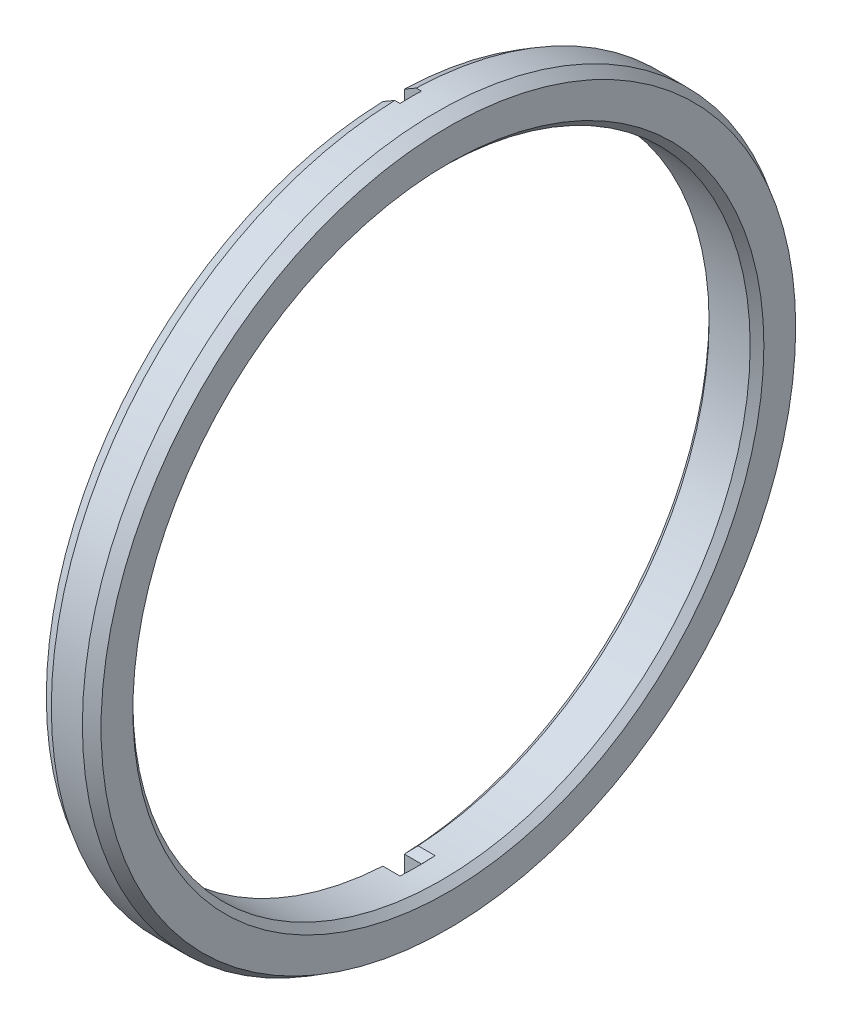
ISO-10303-21;
HEADER;
FILE_DESCRIPTION(('STEP AP214'),'2;1');
FILE_NAME('part.step','',(''),(''),'','','');
FILE_SCHEMA(('AUTOMOTIVE_DESIGN { 1 0 10303 214 1 1 1 1 }'));
ENDSEC;
DATA;
#1=APPLICATION_CONTEXT('core data for automotive mechanical design processes');
#2=APPLICATION_PROTOCOL_DEFINITION('international standard','automotive_design',2000,#1);
#3=PRODUCT_CONTEXT('',#1,'mechanical');
#4=PRODUCT('Part','Part','',(#3));
#5=PRODUCT_RELATED_PRODUCT_CATEGORY('part','',(#4));
#6=PRODUCT_DEFINITION_FORMATION('','',#4);
#7=PRODUCT_DEFINITION_CONTEXT('part definition',#1,'design');
#8=PRODUCT_DEFINITION('design','',#6,#7);
#9=PRODUCT_DEFINITION_SHAPE('','',#8);
#10=(LENGTH_UNIT() NAMED_UNIT(*) SI_UNIT(.MILLI.,.METRE.));
#11=(NAMED_UNIT(*) PLANE_ANGLE_UNIT() SI_UNIT($,.RADIAN.));
#12=(NAMED_UNIT(*) SI_UNIT($,.STERADIAN.) SOLID_ANGLE_UNIT());
#13=UNCERTAINTY_MEASURE_WITH_UNIT(LENGTH_MEASURE(1.E-05),#10,'distance_accuracy_value','');
#14=(GEOMETRIC_REPRESENTATION_CONTEXT(3) GLOBAL_UNCERTAINTY_ASSIGNED_CONTEXT((#13)) GLOBAL_UNIT_ASSIGNED_CONTEXT((#10,
#11,#12)) REPRESENTATION_CONTEXT('',''));
#15=CARTESIAN_POINT('',(0.,0.,0.));
#16=DIRECTION('',(0.,0.,1.));
#17=DIRECTION('',(1.,0.,0.));
#18=AXIS2_PLACEMENT_3D('',#15,#16,#17);
#19=CARTESIAN_POINT('',(2.032,0.,0.));
#20=DIRECTION('',(-1.,0.,0.));
#21=DIRECTION('',(0.,0.,1.));
#22=AXIS2_PLACEMENT_3D('',#19,#20,#21);
#23=CYLINDRICAL_SURFACE('',#22,13.1445);
#24=CARTESIAN_POINT('',(1.59257999999999,0.,0.));
#25=DIRECTION('',(1.,0.,0.));
#26=DIRECTION('',(0.,0.,-1.));
#27=AXIS2_PLACEMENT_3D('',#24,#25,#26);
#28=CIRCLE('',#27,13.1445);
#29=CARTESIAN_POINT('',(1.59257999999999,0.,-13.1445));
#30=VERTEX_POINT('',#29);
#31=EDGE_CURVE('E196',#30,#30,#28,.F.);
#32=ORIENTED_EDGE('',*,*,#31,.T.);
#33=EDGE_LOOP('',(#32));
#34=FACE_BOUND('',#33,.T.);
#35=DIRECTION('',(-1.,0.,0.));
#36=VECTOR('',#35,1.);
#37=CARTESIAN_POINT('',(0.635,13.1385071634632,0.396874999999998));
#38=LINE('',#37,#36);
#39=CARTESIAN_POINT('',(0.635,13.1385071634632,0.396874999999998));
#40=VERTEX_POINT('',#39);
#41=CARTESIAN_POINT('',(0.439420000000001,13.1385071634632,0.396874999999998));
#42=VERTEX_POINT('',#41);
#43=EDGE_CURVE('E173',#40,#42,#38,.T.);
#44=ORIENTED_EDGE('',*,*,#43,.T.);
#45=CARTESIAN_POINT('',(0.439419999999999,0.,0.));
#46=DIRECTION('',(1.,0.,0.));
#47=DIRECTION('',(0.,0.,-1.));
#48=AXIS2_PLACEMENT_3D('',#45,#46,#47);
#49=CIRCLE('',#48,13.1445);
#50=CARTESIAN_POINT('',(0.439420000000001,-13.1385071634632,0.396874999999998));
#51=VERTEX_POINT('',#50);
#52=EDGE_CURVE('E200',#42,#51,#49,.T.);
#53=ORIENTED_EDGE('',*,*,#52,.T.);
#54=DIRECTION('',(-1.,0.,0.));
#55=VECTOR('',#54,1.);
#56=CARTESIAN_POINT('',(0.635,-13.1385071634632,0.396874999999998));
#57=LINE('',#56,#55);
#58=CARTESIAN_POINT('',(0.635,-13.1385071634632,0.396874999999998));
#59=VERTEX_POINT('',#58);
#60=EDGE_CURVE('E190',#59,#51,#57,.T.);
#61=ORIENTED_EDGE('',*,*,#60,.F.);
#62=CARTESIAN_POINT('',(0.635,0.,0.));
#63=DIRECTION('',(1.,0.,0.));
#64=DIRECTION('',(0.,0.,-1.));
#65=AXIS2_PLACEMENT_3D('',#62,#63,#64);
#66=CIRCLE('',#65,13.1445);
#67=CARTESIAN_POINT('',(0.635,-13.1385071634632,-0.396874999999999));
#68=VERTEX_POINT('',#67);
#69=EDGE_CURVE('E182',#59,#68,#66,.T.);
#70=ORIENTED_EDGE('',*,*,#69,.T.);
#71=DIRECTION('',(-1.,0.,0.));
#72=VECTOR('',#71,1.);
#73=CARTESIAN_POINT('',(0.635,-13.1385071634632,-0.396874999999999));
#74=LINE('',#73,#72);
#75=CARTESIAN_POINT('',(0.439420000000001,-13.1385071634632,-0.396874999999999));
#76=VERTEX_POINT('',#75);
#77=EDGE_CURVE('E186',#68,#76,#74,.T.);
#78=ORIENTED_EDGE('',*,*,#77,.T.);
#79=CARTESIAN_POINT('',(0.439419999999999,0.,0.));
#80=DIRECTION('',(1.,0.,0.));
#81=DIRECTION('',(0.,0.,-1.));
#82=AXIS2_PLACEMENT_3D('',#79,#80,#81);
#83=CIRCLE('',#82,13.1445);
#84=CARTESIAN_POINT('',(0.439420000000001,13.1385071634632,-0.396874999999999));
#85=VERTEX_POINT('',#84);
#86=EDGE_CURVE('E171',#76,#85,#83,.T.);
#87=ORIENTED_EDGE('',*,*,#86,.T.);
#88=DIRECTION('',(-1.,0.,0.));
#89=VECTOR('',#88,1.);
#90=CARTESIAN_POINT('',(0.635,13.1385071634632,-0.396874999999999));
#91=LINE('',#90,#89);
#92=CARTESIAN_POINT('',(0.635,13.1385071634632,-0.396874999999999));
#93=VERTEX_POINT('',#92);
#94=EDGE_CURVE('E153',#93,#85,#91,.T.);
#95=ORIENTED_EDGE('',*,*,#94,.F.);
#96=CARTESIAN_POINT('',(0.635,0.,0.));
#97=DIRECTION('',(1.,0.,0.));
#98=DIRECTION('',(0.,0.,-1.));
#99=AXIS2_PLACEMENT_3D('',#96,#97,#98);
#100=CIRCLE('',#99,13.1445);
#101=EDGE_CURVE('E157',#93,#40,#100,.T.);
#102=ORIENTED_EDGE('',*,*,#101,.T.);
#103=EDGE_LOOP('',(#44,#53,#61,#70,#78,#87,#95,#102));
#104=FACE_BOUND('',#103,.T.);
#105=ADVANCED_FACE('F16',(#34,#104),#23,.T.);
#106=CARTESIAN_POINT('',(2.032,0.,0.));
#107=DIRECTION('',(-1.,0.,0.));
#108=DIRECTION('',(0.,0.,1.));
#109=AXIS2_PLACEMENT_3D('',#106,#107,#108);
#110=CYLINDRICAL_SURFACE('',#109,11.4554);
#111=CARTESIAN_POINT('',(0.253999999999999,0.,0.));
#112=DIRECTION('',(1.,0.,0.));
#113=DIRECTION('',(0.,0.,-1.));
#114=AXIS2_PLACEMENT_3D('',#111,#112,#113);
#115=CIRCLE('',#114,11.4554);
#116=CARTESIAN_POINT('',(0.253999999999999,-11.4367385704286,0.653605409762341));
#117=VERTEX_POINT('',#116);
#118=CARTESIAN_POINT('',(0.253999999999999,11.4367385704286,0.653605409762343));
#119=VERTEX_POINT('',#118);
#120=EDGE_CURVE('E412',#117,#119,#115,.F.);
#121=ORIENTED_EDGE('',*,*,#120,.T.);
#122=DIRECTION('',(-1.,0.,0.));
#123=VECTOR('',#122,1.);
#124=CARTESIAN_POINT('',(2.032,11.4367385704286,0.653605409762343));
#125=LINE('',#124,#123);
#126=CARTESIAN_POINT('',(0.888999999999999,11.4367385704286,0.653605409762343));
#127=VERTEX_POINT('',#126);
#128=EDGE_CURVE('E414',#119,#127,#125,.F.);
#129=ORIENTED_EDGE('',*,*,#128,.T.);
#130=CARTESIAN_POINT('',(0.888999999999999,0.,0.));
#131=DIRECTION('',(1.,0.,0.));
#132=DIRECTION('',(0.,0.,-1.));
#133=AXIS2_PLACEMENT_3D('',#130,#131,#132);
#134=CIRCLE('',#133,11.4554);
#135=CARTESIAN_POINT('',(0.888999999999999,11.4367385704286,-0.653605409762338));
#136=VERTEX_POINT('',#135);
#137=EDGE_CURVE('E398',#127,#136,#134,.F.);
#138=ORIENTED_EDGE('',*,*,#137,.T.);
#139=DIRECTION('',(-1.,0.,0.));
#140=VECTOR('',#139,1.);
#141=CARTESIAN_POINT('',(2.032,11.4367385704286,-0.653605409762338));
#142=LINE('',#141,#140);
#143=CARTESIAN_POINT('',(0.253999999999999,11.4367385704286,-0.653605409762338));
#144=VERTEX_POINT('',#143);
#145=EDGE_CURVE('E399',#136,#144,#142,.T.);
#146=ORIENTED_EDGE('',*,*,#145,.T.);
#147=CARTESIAN_POINT('',(0.253999999999999,0.,0.));
#148=DIRECTION('',(1.,0.,0.));
#149=DIRECTION('',(0.,0.,-1.));
#150=AXIS2_PLACEMENT_3D('',#147,#148,#149);
#151=CIRCLE('',#150,11.4554);
#152=CARTESIAN_POINT('',(0.253999999999999,-11.4367385704286,-0.653605409762342));
#153=VERTEX_POINT('',#152);
#154=EDGE_CURVE('E404',#144,#153,#151,.F.);
#155=ORIENTED_EDGE('',*,*,#154,.T.);
#156=DIRECTION('',(-1.,0.,0.));
#157=VECTOR('',#156,1.);
#158=CARTESIAN_POINT('',(2.032,-11.4367385704286,-0.653605409762342));
#159=LINE('',#158,#157);
#160=CARTESIAN_POINT('',(0.888999999999999,-11.4367385704286,-0.653605409762342));
#161=VERTEX_POINT('',#160);
#162=EDGE_CURVE('E406',#153,#161,#159,.F.);
#163=ORIENTED_EDGE('',*,*,#162,.T.);
#164=CARTESIAN_POINT('',(0.888999999999999,0.,0.));
#165=DIRECTION('',(1.,0.,0.));
#166=DIRECTION('',(0.,0.,-1.));
#167=AXIS2_PLACEMENT_3D('',#164,#165,#166);
#168=CIRCLE('',#167,11.4554);
#169=CARTESIAN_POINT('',(0.888999999999999,-11.4367385704286,0.653605409762341));
#170=VERTEX_POINT('',#169);
#171=EDGE_CURVE('E408',#161,#170,#168,.F.);
#172=ORIENTED_EDGE('',*,*,#171,.T.);
#173=DIRECTION('',(-1.,0.,0.));
#174=VECTOR('',#173,1.);
#175=CARTESIAN_POINT('',(2.032,-11.4367385704286,0.653605409762341));
#176=LINE('',#175,#174);
#177=EDGE_CURVE('E410',#170,#117,#176,.T.);
#178=ORIENTED_EDGE('',*,*,#177,.T.);
#179=EDGE_LOOP('',(#121,#129,#138,#146,#155,#163,#172,#178));
#180=FACE_BOUND('',#179,.T.);
#181=CARTESIAN_POINT('',(1.77800000000001,0.,0.));
#182=DIRECTION('',(1.,0.,0.));
#183=DIRECTION('',(0.,0.,-1.));
#184=AXIS2_PLACEMENT_3D('',#181,#182,#183);
#185=CIRCLE('',#184,11.4554);
#186=CARTESIAN_POINT('',(1.77800000000001,0.,-11.4554));
#187=VERTEX_POINT('',#186);
#188=EDGE_CURVE('E396',#187,#187,#185,.T.);
#189=ORIENTED_EDGE('',*,*,#188,.T.);
#190=EDGE_LOOP('',(#189));
#191=FACE_BOUND('',#190,.T.);
#192=ADVANCED_FACE('F454',(#180,#191),#110,.F.);
#193=CARTESIAN_POINT('',(0.,0.,-29.0593213562373));
#194=DIRECTION('',(1.,0.,0.));
#195=DIRECTION('',(0.,0.,-1.));
#196=AXIS2_PLACEMENT_3D('',#193,#194,#195);
#197=PLANE('',#196);
#198=DIRECTION('',(0.,-1.,0.));
#199=VECTOR('',#198,1.);
#200=CARTESIAN_POINT('',(0.,0.,-0.396874999999997));
#201=LINE('',#200,#199);
#202=CARTESIAN_POINT('',(0.,-11.7026722843278,-0.396874999999999));
#203=VERTEX_POINT('',#202);
#204=CARTESIAN_POINT('',(0.,-12.8843890225488,-0.396874999999999));
#205=VERTEX_POINT('',#204);
#206=EDGE_CURVE('E175',#203,#205,#201,.T.);
#207=ORIENTED_EDGE('',*,*,#206,.F.);
#208=CARTESIAN_POINT('',(0.,0.,0.));
#209=DIRECTION('',(1.,0.,0.));
#210=DIRECTION('',(0.,0.,-1.));
#211=AXIS2_PLACEMENT_3D('',#208,#209,#210);
#212=CIRCLE('',#211,11.7094);
#213=CARTESIAN_POINT('',(0.,11.7026722843278,-0.396874999999999));
#214=VERTEX_POINT('',#213);
#215=EDGE_CURVE('E377',#203,#214,#212,.T.);
#216=ORIENTED_EDGE('',*,*,#215,.T.);
#217=DIRECTION('',(0.,1.,0.));
#218=VECTOR('',#217,1.);
#219=CARTESIAN_POINT('',(0.,0.,-0.396874999999997));
#220=LINE('',#219,#218);
#221=CARTESIAN_POINT('',(0.,12.8843890225488,-0.396874999999999));
#222=VERTEX_POINT('',#221);
#223=EDGE_CURVE('E442',#214,#222,#220,.T.);
#224=ORIENTED_EDGE('',*,*,#223,.T.);
#225=CARTESIAN_POINT('',(0.,0.,0.));
#226=DIRECTION('',(1.,0.,0.));
#227=DIRECTION('',(0.,0.,-1.));
#228=AXIS2_PLACEMENT_3D('',#225,#226,#227);
#229=CIRCLE('',#228,12.8905);
#230=EDGE_CURVE('E461',#222,#205,#229,.F.);
#231=ORIENTED_EDGE('',*,*,#230,.T.);
#232=EDGE_LOOP('',(#207,#216,#224,#231));
#233=FACE_BOUND('',#232,.T.);
#234=ADVANCED_FACE('F459',(#233),#197,.F.);
#235=DIRECTION('',(0.,-1.,0.));
#236=VECTOR('',#235,1.);
#237=CARTESIAN_POINT('',(0.,0.,0.396875));
#238=LINE('',#237,#236);
#239=CARTESIAN_POINT('',(0.,12.8843890225488,0.396874999999998));
#240=VERTEX_POINT('',#239);
#241=CARTESIAN_POINT('',(0.,11.7026722843278,0.396874999999999));
#242=VERTEX_POINT('',#241);
#243=EDGE_CURVE('E158',#240,#242,#238,.T.);
#244=ORIENTED_EDGE('',*,*,#243,.T.);
#245=CARTESIAN_POINT('',(0.,0.,0.));
#246=DIRECTION('',(1.,0.,0.));
#247=DIRECTION('',(0.,0.,-1.));
#248=AXIS2_PLACEMENT_3D('',#245,#246,#247);
#249=CIRCLE('',#248,11.7094);
#250=CARTESIAN_POINT('',(0.,-11.7026722843278,0.396874999999999));
#251=VERTEX_POINT('',#250);
#252=EDGE_CURVE('E417',#242,#251,#249,.T.);
#253=ORIENTED_EDGE('',*,*,#252,.T.);
#254=DIRECTION('',(0.,-1.,0.));
#255=VECTOR('',#254,1.);
#256=CARTESIAN_POINT('',(0.,0.,0.396875));
#257=LINE('',#256,#255);
#258=CARTESIAN_POINT('',(0.,-12.8843890225488,0.396874999999998));
#259=VERTEX_POINT('',#258);
#260=EDGE_CURVE('E172',#251,#259,#257,.T.);
#261=ORIENTED_EDGE('',*,*,#260,.T.);
#262=CARTESIAN_POINT('',(0.,0.,0.));
#263=DIRECTION('',(1.,0.,0.));
#264=DIRECTION('',(0.,0.,-1.));
#265=AXIS2_PLACEMENT_3D('',#262,#263,#264);
#266=CIRCLE('',#265,12.8905);
#267=EDGE_CURVE('E212',#259,#240,#266,.F.);
#268=ORIENTED_EDGE('',*,*,#267,.T.);
#269=EDGE_LOOP('',(#244,#253,#261,#268));
#270=FACE_BOUND('',#269,.T.);
#271=ADVANCED_FACE('F490',(#270),#197,.F.);
#272=CARTESIAN_POINT('',(2.032,0.,-29.0593213562373));
#273=DIRECTION('',(1.,0.,0.));
#274=DIRECTION('',(0.,0.,-1.));
#275=AXIS2_PLACEMENT_3D('',#272,#273,#274);
#276=PLANE('',#275);
#277=CARTESIAN_POINT('',(2.032,0.,0.));
#278=DIRECTION('',(1.,0.,0.));
#279=DIRECTION('',(0.,0.,-1.));
#280=AXIS2_PLACEMENT_3D('',#277,#278,#279);
#281=CIRCLE('',#280,11.7094);
#282=CARTESIAN_POINT('',(2.032,0.,-11.7094));
#283=VERTEX_POINT('',#282);
#284=EDGE_CURVE('E354',#283,#283,#281,.F.);
#285=ORIENTED_EDGE('',*,*,#284,.T.);
#286=EDGE_LOOP('',(#285));
#287=FACE_BOUND('',#286,.T.);
#288=CARTESIAN_POINT('',(2.032,0.,0.));
#289=DIRECTION('',(1.,0.,0.));
#290=DIRECTION('',(0.,0.,-1.));
#291=AXIS2_PLACEMENT_3D('',#288,#289,#290);
#292=CIRCLE('',#291,12.8905);
#293=CARTESIAN_POINT('',(2.032,0.,-12.8905));
#294=VERTEX_POINT('',#293);
#295=EDGE_CURVE('E193',#294,#294,#292,.T.);
#296=ORIENTED_EDGE('',*,*,#295,.T.);
#297=EDGE_LOOP('',(#296));
#298=FACE_BOUND('',#297,.T.);
#299=ADVANCED_FACE('F389',(#287,#298),#276,.T.);
#300=CARTESIAN_POINT('',(0.635,0.,0.396875));
#301=DIRECTION('',(0.,0.,-1.));
#302=DIRECTION('',(0.,1.,0.));
#303=AXIS2_PLACEMENT_3D('',#300,#301,#302);
#304=PLANE('',#303);
#305=ORIENTED_EDGE('',*,*,#260,.F.);
#306=CARTESIAN_POINT('',(0.,-11.7026722843278,0.396874999999999));
#307=CARTESIAN_POINT('',(2.4862694895759E-05,-11.7026474073395,0.396874999999999));
#308=CARTESIAN_POINT('',(4.97253897916626E-05,-11.7026225303512,0.396874999999999));
#309=CARTESIAN_POINT('',(9.94507795834698E-05,-11.7025727763746,0.396874999999999));
#310=CARTESIAN_POINT('',(0.000124313474479373,-11.7025478993862,0.396874999999999));
#311=CARTESIAN_POINT('',(0.000149176169375422,-11.7025230223979,0.396874999999999));
#312=B_SPLINE_CURVE_WITH_KNOTS('',3,(#306,#307,#308,#309,#310,#311),.UNSPECIFIED.,.F.,.F.,(4,2,
4),(0.,0.000105513806248405,0.000211027612495582),.UNSPECIFIED.);
#313=CARTESIAN_POINT('',(0.000149176169375598,-11.7025230223979,0.396874999999999));
#314=VERTEX_POINT('',#313);
#315=EDGE_CURVE('E420',#251,#314,#312,.T.);
#316=ORIENTED_EDGE('',*,*,#315,.T.);
#317=DIRECTION('',(1.,0.,0.));
#318=VECTOR('',#317,1.);
#319=CARTESIAN_POINT('',(0.635,-11.7025230223979,0.396874999999999));
#320=LINE('',#319,#318);
#321=CARTESIAN_POINT('',(0.635149176169376,-11.7025230223979,0.396874999999999));
#322=VERTEX_POINT('',#321);
#323=EDGE_CURVE('E419',#314,#322,#320,.T.);
#324=ORIENTED_EDGE('',*,*,#323,.T.);
#325=CARTESIAN_POINT('',(0.635149176169376,-11.7025230223979,0.396874999999999));
#326=CARTESIAN_POINT('',(0.63512431347448,-11.7025478993862,0.396874999999999));
#327=CARTESIAN_POINT('',(0.635099450779584,-11.7025727763746,0.396874999999999));
#328=CARTESIAN_POINT('',(0.635049725389792,-11.7026225303512,0.396874999999999));
#329=CARTESIAN_POINT('',(0.635024862694896,-11.7026474073395,0.396874999999999));
#330=CARTESIAN_POINT('',(0.635,-11.7026722843278,0.396874999999999));
#331=B_SPLINE_CURVE_WITH_KNOTS('',3,(#325,#326,#327,#328,#329,#330),.UNSPECIFIED.,.F.,.F.,(4,2,
4),(0.,0.00010551380624724,0.000211027612495784),.UNSPECIFIED.);
#332=CARTESIAN_POINT('',(0.635,-11.7026722843278,0.396874999999999));
#333=VERTEX_POINT('',#332);
#334=EDGE_CURVE('E353',#322,#333,#331,.T.);
#335=ORIENTED_EDGE('',*,*,#334,.T.);
#336=DIRECTION('',(0.,-1.,0.));
#337=VECTOR('',#336,1.);
#338=CARTESIAN_POINT('',(0.635,0.,0.396875));
#339=LINE('',#338,#337);
#340=EDGE_CURVE('E180',#333,#59,#339,.T.);
#341=ORIENTED_EDGE('',*,*,#340,.T.);
#342=ORIENTED_EDGE('',*,*,#60,.T.);
#343=CARTESIAN_POINT('',(0.439419999999999,-13.1385071634632,0.396874999999998));
#344=CARTESIAN_POINT('',(0.366183166717385,-13.0961544280891,0.396874999999998));
#345=CARTESIAN_POINT('',(0.292946416742746,-13.0538015486591,0.396874999999998));
#346=CARTESIAN_POINT('',(0.146473083409413,-12.9690955016876,0.396874999999998));
#347=CARTESIAN_POINT('',(0.0732365000507189,-12.9267423341461,0.396874999999998));
#348=CARTESIAN_POINT('',(0.,-12.8843890225488,0.396874999999998));
#349=B_SPLINE_CURVE_WITH_KNOTS('',3,(#343,#344,#345,#346,#347,#348),.UNSPECIFIED.,.F.,.F.,(4,2,
4),(0.,0.25380404150782,0.507608083015659),.UNSPECIFIED.);
#350=EDGE_CURVE('E203',#51,#259,#349,.T.);
#351=ORIENTED_EDGE('',*,*,#350,.T.);
#352=EDGE_LOOP('',(#305,#316,#324,#335,#341,#342,#351));
#353=FACE_BOUND('',#352,.T.);
#354=ADVANCED_FACE('F214',(#353),#304,.T.);
#355=CARTESIAN_POINT('',(0.635,0.,-0.396874999999997));
#356=DIRECTION('',(0.,0.,-1.));
#357=DIRECTION('',(0.,1.,0.));
#358=AXIS2_PLACEMENT_3D('',#355,#356,#357);
#359=PLANE('',#358);
#360=CARTESIAN_POINT('',(0.635,-11.7026722843278,-0.396874999999999));
#361=CARTESIAN_POINT('',(0.635024862694897,-11.7026474073395,-0.396874999999999));
#362=CARTESIAN_POINT('',(0.635049725389793,-11.7026225303512,-0.396874999999999));
#363=CARTESIAN_POINT('',(0.635099450779586,-11.7025727763746,-0.396874999999999));
#364=CARTESIAN_POINT('',(0.635124313474483,-11.7025478993862,-0.396874999999999));
#365=CARTESIAN_POINT('',(0.635149176169379,-11.7025230223979,-0.396874999999999));
#366=B_SPLINE_CURVE_WITH_KNOTS('',3,(#360,#361,#362,#363,#364,#365),.UNSPECIFIED.,.F.,.F.,(4,2,
4),(0.,0.000105513806249617,0.000211027612500537),.UNSPECIFIED.);
#367=CARTESIAN_POINT('',(0.635,-11.7026722843278,-0.396874999999999));
#368=VERTEX_POINT('',#367);
#369=CARTESIAN_POINT('',(0.635149176169379,-11.7025230223979,-0.396874999999999));
#370=VERTEX_POINT('',#369);
#371=EDGE_CURVE('E347',#368,#370,#366,.T.);
#372=ORIENTED_EDGE('',*,*,#371,.T.);
#373=DIRECTION('',(-1.,0.,0.));
#374=VECTOR('',#373,1.);
#375=CARTESIAN_POINT('',(0.,-11.7025230223979,-0.396874999999999));
#376=LINE('',#375,#374);
#377=CARTESIAN_POINT('',(0.000149176169379067,-11.7025230223979,-0.396874999999999));
#378=VERTEX_POINT('',#377);
#379=EDGE_CURVE('E45',#370,#378,#376,.T.);
#380=ORIENTED_EDGE('',*,*,#379,.T.);
#381=CARTESIAN_POINT('',(0.000149176169379067,-11.7025230223979,-0.396874999999999));
#382=CARTESIAN_POINT('',(0.000124313474482679,-11.7025478993862,-0.396874999999999));
#383=CARTESIAN_POINT('',(9.94507795861469E-05,-11.7025727763746,-0.396874999999999));
#384=CARTESIAN_POINT('',(4.97253897930824E-05,-11.7026225303512,-0.396874999999999));
#385=CARTESIAN_POINT('',(2.48626948965501E-05,-11.7026474073395,-0.396874999999999));
#386=CARTESIAN_POINT('',(0.,-11.7026722843278,-0.396874999999999));
#387=B_SPLINE_CURVE_WITH_KNOTS('',3,(#381,#382,#383,#384,#385,#386),.UNSPECIFIED.,.F.,.F.,(4,2,
4),(0.,0.000105513806250965,0.000211027612500703),.UNSPECIFIED.);
#388=EDGE_CURVE('E368',#378,#203,#387,.T.);
#389=ORIENTED_EDGE('',*,*,#388,.T.);
#390=ORIENTED_EDGE('',*,*,#206,.T.);
#391=CARTESIAN_POINT('',(0.,-12.8843890225488,-0.396874999999999));
#392=CARTESIAN_POINT('',(0.0732365000507185,-12.9267423341461,-0.396874999999999));
#393=CARTESIAN_POINT('',(0.146473083409412,-12.9690955016876,-0.396874999999999));
#394=CARTESIAN_POINT('',(0.292946416742746,-13.0538015486591,-0.396874999999999));
#395=CARTESIAN_POINT('',(0.366183166717385,-13.0961544280891,-0.396874999999999));
#396=CARTESIAN_POINT('',(0.43942,-13.1385071634632,-0.396874999999999));
#397=B_SPLINE_CURVE_WITH_KNOTS('',3,(#391,#392,#393,#394,#395,#396),.UNSPECIFIED.,.F.,.F.,(4,2,
4),(0.,0.253804041507839,0.507608083015658),.UNSPECIFIED.);
#398=EDGE_CURVE('E263',#205,#76,#397,.T.);
#399=ORIENTED_EDGE('',*,*,#398,.T.);
#400=ORIENTED_EDGE('',*,*,#77,.F.);
#401=DIRECTION('',(0.,-1.,0.));
#402=VECTOR('',#401,1.);
#403=CARTESIAN_POINT('',(0.635,0.,-0.396874999999997));
#404=LINE('',#403,#402);
#405=EDGE_CURVE('E185',#368,#68,#404,.T.);
#406=ORIENTED_EDGE('',*,*,#405,.F.);
#407=EDGE_LOOP('',(#372,#380,#389,#390,#399,#400,#406));
#408=FACE_BOUND('',#407,.T.);
#409=ADVANCED_FACE('F360',(#408),#359,.F.);
#410=CARTESIAN_POINT('',(0.635,0.,0.));
#411=DIRECTION('',(1.,0.,0.));
#412=DIRECTION('',(0.,0.,-1.));
#413=AXIS2_PLACEMENT_3D('',#410,#411,#412);
#414=PLANE('',#413);
#415=ORIENTED_EDGE('',*,*,#340,.F.);
#416=CARTESIAN_POINT('',(0.635,0.,0.));
#417=DIRECTION('',(1.,0.,0.));
#418=DIRECTION('',(0.,0.,-1.));
#419=AXIS2_PLACEMENT_3D('',#416,#417,#418);
#420=CIRCLE('',#419,11.7094);
#421=EDGE_CURVE('E375',#333,#368,#420,.T.);
#422=ORIENTED_EDGE('',*,*,#421,.T.);
#423=ORIENTED_EDGE('',*,*,#405,.T.);
#424=ORIENTED_EDGE('',*,*,#69,.F.);
#425=EDGE_LOOP('',(#415,#422,#423,#424));
#426=FACE_BOUND('',#425,.T.);
#427=ADVANCED_FACE('F363',(#426),#414,.F.);
#428=CARTESIAN_POINT('',(0.635,0.,-0.396874999999997));
#429=DIRECTION('',(0.,0.,1.));
#430=DIRECTION('',(0.,-1.,0.));
#431=AXIS2_PLACEMENT_3D('',#428,#429,#430);
#432=PLANE('',#431);
#433=ORIENTED_EDGE('',*,*,#223,.F.);
#434=CARTESIAN_POINT('',(0.,11.7026722843278,-0.396874999999999));
#435=CARTESIAN_POINT('',(2.48626948966264E-05,11.7026474073395,-0.396874999999999));
#436=CARTESIAN_POINT('',(4.97253897931083E-05,11.7026225303512,-0.396874999999999));
#437=CARTESIAN_POINT('',(9.94507795860721E-05,11.7025727763746,-0.396874999999999));
#438=CARTESIAN_POINT('',(0.000124313474482554,11.7025478993862,-0.396874999999999));
#439=CARTESIAN_POINT('',(0.000149176169378891,11.7025230223979,-0.396874999999999));
#440=B_SPLINE_CURVE_WITH_KNOTS('',3,(#434,#435,#436,#437,#438,#439),.UNSPECIFIED.,.F.,.F.,(4,2,
4),(0.,0.000105513806249631,0.000211027612500489),.UNSPECIFIED.);
#441=CARTESIAN_POINT('',(0.000149176169379067,11.7025230223979,-0.396874999999999));
#442=VERTEX_POINT('',#441);
#443=EDGE_CURVE('E380',#214,#442,#440,.T.);
#444=ORIENTED_EDGE('',*,*,#443,.T.);
#445=DIRECTION('',(1.,0.,0.));
#446=VECTOR('',#445,1.);
#447=CARTESIAN_POINT('',(0.635,11.7025230223979,-0.396874999999999));
#448=LINE('',#447,#446);
#449=CARTESIAN_POINT('',(0.635149176169379,11.7025230223979,-0.396874999999999));
#450=VERTEX_POINT('',#449);
#451=EDGE_CURVE('E37',#442,#450,#448,.T.);
#452=ORIENTED_EDGE('',*,*,#451,.T.);
#453=CARTESIAN_POINT('',(0.635149176169379,11.7025230223979,-0.396874999999999));
#454=CARTESIAN_POINT('',(0.635124313474483,11.7025478993862,-0.396874999999999));
#455=CARTESIAN_POINT('',(0.635099450779586,11.7025727763746,-0.396874999999999));
#456=CARTESIAN_POINT('',(0.635049725389793,11.7026225303512,-0.396874999999999));
#457=CARTESIAN_POINT('',(0.635024862694897,11.7026474073395,-0.396874999999999));
#458=CARTESIAN_POINT('',(0.635,11.7026722843278,-0.396874999999999));
#459=B_SPLINE_CURVE_WITH_KNOTS('',3,(#453,#454,#455,#456,#457,#458),.UNSPECIFIED.,.F.,.F.,(4,2,
4),(0.,0.00010551380625092,0.00021102761250069),.UNSPECIFIED.);
#460=CARTESIAN_POINT('',(0.635,11.7026722843278,-0.396874999999999));
#461=VERTEX_POINT('',#460);
#462=EDGE_CURVE('E11',#450,#461,#459,.T.);
#463=ORIENTED_EDGE('',*,*,#462,.T.);
#464=DIRECTION('',(0.,1.,0.));
#465=VECTOR('',#464,1.);
#466=CARTESIAN_POINT('',(0.635,0.,-0.396874999999997));
#467=LINE('',#466,#465);
#468=EDGE_CURVE('E147',#461,#93,#467,.T.);
#469=ORIENTED_EDGE('',*,*,#468,.T.);
#470=ORIENTED_EDGE('',*,*,#94,.T.);
#471=CARTESIAN_POINT('',(0.439419999999999,13.1385071634632,-0.396874999999999));
#472=CARTESIAN_POINT('',(0.366183166717385,13.0961544280891,-0.396874999999999));
#473=CARTESIAN_POINT('',(0.292946416742746,13.0538015486591,-0.396874999999999));
#474=CARTESIAN_POINT('',(0.146473083409413,12.9690955016876,-0.396874999999999));
#475=CARTESIAN_POINT('',(0.0732365000507189,12.9267423341461,-0.396874999999999));
#476=CARTESIAN_POINT('',(0.,12.8843890225488,-0.396874999999999));
#477=B_SPLINE_CURVE_WITH_KNOTS('',3,(#471,#472,#473,#474,#475,#476),.UNSPECIFIED.,.F.,.F.,(4,2,
4),(0.,0.25380404150782,0.507608083015659),.UNSPECIFIED.);
#478=EDGE_CURVE('E237',#85,#222,#477,.T.);
#479=ORIENTED_EDGE('',*,*,#478,.T.);
#480=EDGE_LOOP('',(#433,#444,#452,#463,#469,#470,#479));
#481=FACE_BOUND('',#480,.T.);
#482=ADVANCED_FACE('F150',(#481),#432,.T.);
#483=CARTESIAN_POINT('',(0.635,0.,0.396875));
#484=DIRECTION('',(0.,0.,-1.));
#485=DIRECTION('',(0.,1.,0.));
#486=AXIS2_PLACEMENT_3D('',#483,#484,#485);
#487=PLANE('',#486);
#488=DIRECTION('',(0.,-1.,0.));
#489=VECTOR('',#488,1.);
#490=CARTESIAN_POINT('',(0.635,0.,0.396875));
#491=LINE('',#490,#489);
#492=CARTESIAN_POINT('',(0.635,11.7026722843278,0.396874999999999));
#493=VERTEX_POINT('',#492);
#494=EDGE_CURVE('E164',#40,#493,#491,.T.);
#495=ORIENTED_EDGE('',*,*,#494,.T.);
#496=CARTESIAN_POINT('',(0.635,11.7026722843278,0.396874999999999));
#497=CARTESIAN_POINT('',(0.635024862694897,11.7026474073395,0.396874999999999));
#498=CARTESIAN_POINT('',(0.635049725389793,11.7026225303512,0.396874999999999));
#499=CARTESIAN_POINT('',(0.635099450779586,11.7025727763746,0.396874999999999));
#500=CARTESIAN_POINT('',(0.635124313474483,11.7025478993862,0.396874999999999));
#501=CARTESIAN_POINT('',(0.635149176169379,11.7025230223979,0.396874999999999));
#502=B_SPLINE_CURVE_WITH_KNOTS('',3,(#496,#497,#498,#499,#500,#501),.UNSPECIFIED.,.F.,.F.,(4,2,
4),(0.,0.000105513806250997,0.00021102761250207),.UNSPECIFIED.);
#503=CARTESIAN_POINT('',(0.635149176169379,11.7025230223979,0.396874999999999));
#504=VERTEX_POINT('',#503);
#505=EDGE_CURVE('E30',#493,#504,#502,.T.);
#506=ORIENTED_EDGE('',*,*,#505,.T.);
#507=DIRECTION('',(-1.,0.,0.));
#508=VECTOR('',#507,1.);
#509=CARTESIAN_POINT('',(0.635,11.7025230223979,0.396874999999999));
#510=LINE('',#509,#508);
#511=CARTESIAN_POINT('',(0.000149176169379066,11.7025230223979,0.396874999999999));
#512=VERTEX_POINT('',#511);
#513=EDGE_CURVE('E262',#504,#512,#510,.T.);
#514=ORIENTED_EDGE('',*,*,#513,.T.);
#515=CARTESIAN_POINT('',(0.000149176169379066,11.7025230223979,0.396874999999999));
#516=CARTESIAN_POINT('',(0.000124313474482678,11.7025478993862,0.396874999999999));
#517=CARTESIAN_POINT('',(9.94507795861457E-05,11.7025727763746,0.396874999999999));
#518=CARTESIAN_POINT('',(4.97253897930813E-05,11.7026225303512,0.396874999999999));
#519=CARTESIAN_POINT('',(2.48626948965491E-05,11.7026474073395,0.396874999999999));
#520=CARTESIAN_POINT('',(0.,11.7026722843278,0.396874999999999));
#521=B_SPLINE_CURVE_WITH_KNOTS('',3,(#515,#516,#517,#518,#519,#520),.UNSPECIFIED.,.F.,.F.,(4,2,
4),(0.,0.000105513806250965,0.000211027612500703),.UNSPECIFIED.);
#522=EDGE_CURVE('E255',#512,#242,#521,.T.);
#523=ORIENTED_EDGE('',*,*,#522,.T.);
#524=ORIENTED_EDGE('',*,*,#243,.F.);
#525=CARTESIAN_POINT('',(0.,12.8843890225488,0.396874999999998));
#526=CARTESIAN_POINT('',(0.0732365000507185,12.9267423341461,0.396874999999998));
#527=CARTESIAN_POINT('',(0.146473083409412,12.9690955016876,0.396874999999998));
#528=CARTESIAN_POINT('',(0.292946416742746,13.0538015486591,0.396874999999998));
#529=CARTESIAN_POINT('',(0.366183166717385,13.0961544280891,0.396874999999998));
#530=CARTESIAN_POINT('',(0.43942,13.1385071634632,0.396874999999998));
#531=B_SPLINE_CURVE_WITH_KNOTS('',3,(#525,#526,#527,#528,#529,#530),.UNSPECIFIED.,.F.,.F.,(4,2,
4),(0.,0.253804041507839,0.507608083015658),.UNSPECIFIED.);
#532=EDGE_CURVE('E230',#240,#42,#531,.T.);
#533=ORIENTED_EDGE('',*,*,#532,.T.);
#534=ORIENTED_EDGE('',*,*,#43,.F.);
#535=EDGE_LOOP('',(#495,#506,#514,#523,#524,#533,#534));
#536=FACE_BOUND('',#535,.T.);
#537=ADVANCED_FACE('F244',(#536),#487,.T.);
#538=CARTESIAN_POINT('',(0.635,0.,0.));
#539=DIRECTION('',(1.,0.,0.));
#540=DIRECTION('',(0.,0.,-1.));
#541=AXIS2_PLACEMENT_3D('',#538,#539,#540);
#542=PLANE('',#541);
#543=ORIENTED_EDGE('',*,*,#468,.F.);
#544=CARTESIAN_POINT('',(0.635,0.,0.));
#545=DIRECTION('',(1.,0.,0.));
#546=DIRECTION('',(0.,0.,-1.));
#547=AXIS2_PLACEMENT_3D('',#544,#545,#546);
#548=CIRCLE('',#547,11.7094);
#549=EDGE_CURVE('E385',#461,#493,#548,.T.);
#550=ORIENTED_EDGE('',*,*,#549,.T.);
#551=ORIENTED_EDGE('',*,*,#494,.F.);
#552=ORIENTED_EDGE('',*,*,#101,.F.);
#553=EDGE_LOOP('',(#543,#550,#551,#552));
#554=FACE_BOUND('',#553,.T.);
#555=ADVANCED_FACE('F162',(#554),#542,.F.);
#556=CARTESIAN_POINT('',(2.032,0.,0.));
#557=DIRECTION('',(-1.,0.,0.));
#558=DIRECTION('',(0.,0.,1.));
#559=AXIS2_PLACEMENT_3D('',#556,#557,#558);
#560=CONICAL_SURFACE('',#559,12.8905,0.52411193314262);
#561=ORIENTED_EDGE('',*,*,#31,.F.);
#562=EDGE_LOOP('',(#561));
#563=FACE_BOUND('',#562,.T.);
#564=ORIENTED_EDGE('',*,*,#295,.F.);
#565=EDGE_LOOP('',(#564));
#566=FACE_BOUND('',#565,.T.);
#567=ADVANCED_FACE('F224',(#563,#566),#560,.T.);
#568=CARTESIAN_POINT('',(0.439419999999999,0.,0.));
#569=DIRECTION('',(1.,0.,0.));
#570=DIRECTION('',(0.,0.,-1.));
#571=AXIS2_PLACEMENT_3D('',#568,#569,#570);
#572=CONICAL_SURFACE('',#571,13.1445,0.524111933142621);
#573=ORIENTED_EDGE('',*,*,#532,.F.);
#574=ORIENTED_EDGE('',*,*,#267,.F.);
#575=ORIENTED_EDGE('',*,*,#350,.F.);
#576=ORIENTED_EDGE('',*,*,#52,.F.);
#577=EDGE_LOOP('',(#573,#574,#575,#576));
#578=FACE_BOUND('',#577,.T.);
#579=ADVANCED_FACE('F218',(#578),#572,.T.);
#580=CARTESIAN_POINT('',(0.439419999999999,0.,0.));
#581=DIRECTION('',(1.,0.,0.));
#582=DIRECTION('',(0.,0.,-1.));
#583=AXIS2_PLACEMENT_3D('',#580,#581,#582);
#584=CONICAL_SURFACE('',#583,13.1445,0.524111933142621);
#585=ORIENTED_EDGE('',*,*,#398,.F.);
#586=ORIENTED_EDGE('',*,*,#230,.F.);
#587=ORIENTED_EDGE('',*,*,#478,.F.);
#588=ORIENTED_EDGE('',*,*,#86,.F.);
#589=EDGE_LOOP('',(#585,#586,#587,#588));
#590=FACE_BOUND('',#589,.T.);
#591=ADVANCED_FACE('F223',(#590),#584,.T.);
#592=CARTESIAN_POINT('',(2.032,-11.7025230223979,-0.396874999999999));
#593=DIRECTION('',(0.,-0.694749871242897,-0.719251427810872));
#594=DIRECTION('',(0.,0.719251427810872,-0.694749871242897));
#595=AXIS2_PLACEMENT_3D('',#592,#593,#594);
#596=PLANE('',#595);
#597=CARTESIAN_POINT('',(0.635149176169379,-11.7025230223979,-0.396874999999999));
#598=CARTESIAN_POINT('',(0.677810136025225,-11.6583997827528,-0.439495165740315));
#599=CARTESIAN_POINT('',(0.720294849389631,-11.6141894605951,-0.482199447496362));
#600=CARTESIAN_POINT('',(0.804911790729776,-11.5255946433033,-0.56777625072028));
#601=CARTESIAN_POINT('',(0.847044018642243,-11.4812101481379,-0.610648772218346));
#602=CARTESIAN_POINT('',(0.888999999999999,-11.4367385704286,-0.653605409762342));
#603=B_SPLINE_CURVE_WITH_KNOTS('',3,(#597,#598,#599,#600,#601,#602),.UNSPECIFIED.,.F.,.F.,(4,2,
4),(0.,0.224161620749842,0.448323281735865),.UNSPECIFIED.);
#604=EDGE_CURVE('E341',#161,#370,#603,.F.);
#605=ORIENTED_EDGE('',*,*,#604,.F.);
#606=ORIENTED_EDGE('',*,*,#162,.F.);
#607=CARTESIAN_POINT('',(0.000149176169379067,-11.7025230223979,-0.396874999999999));
#608=CARTESIAN_POINT('',(0.0428101360252251,-11.6583997827528,-0.439495165740315));
#609=CARTESIAN_POINT('',(0.0852948493896309,-11.6141894605951,-0.482199447496362));
#610=CARTESIAN_POINT('',(0.169911790729776,-11.5255946433033,-0.56777625072028));
#611=CARTESIAN_POINT('',(0.212044018642243,-11.4812101481379,-0.610648772218346));
#612=CARTESIAN_POINT('',(0.253999999999999,-11.4367385704286,-0.653605409762342));
#613=B_SPLINE_CURVE_WITH_KNOTS('',3,(#607,#608,#609,#610,#611,#612),.UNSPECIFIED.,.F.,.F.,(4,2,
4),(0.,0.224161620749842,0.448323281735865),.UNSPECIFIED.);
#614=EDGE_CURVE('E20',#378,#153,#613,.T.);
#615=ORIENTED_EDGE('',*,*,#614,.F.);
#616=ORIENTED_EDGE('',*,*,#379,.F.);
#617=EDGE_LOOP('',(#605,#606,#615,#616));
#618=FACE_BOUND('',#617,.T.);
#619=ADVANCED_FACE('F455',(#618),#596,.F.);
#620=CARTESIAN_POINT('',(0.,0.,0.));
#621=DIRECTION('',(-1.,0.,0.));
#622=DIRECTION('',(0.,0.,1.));
#623=AXIS2_PLACEMENT_3D('',#620,#621,#622);
#624=CONICAL_SURFACE('',#623,11.7094,0.785398163397452);
#625=ORIENTED_EDGE('',*,*,#614,.T.);
#626=ORIENTED_EDGE('',*,*,#154,.F.);
#627=CARTESIAN_POINT('',(0.000149176169379067,11.7025230223979,-0.396874999999999));
#628=CARTESIAN_POINT('',(0.0428101360252251,11.6583997827528,-0.439495165740314));
#629=CARTESIAN_POINT('',(0.0852948493896309,11.6141894605951,-0.482199447496361));
#630=CARTESIAN_POINT('',(0.169911790729776,11.5255946433033,-0.567776250720277));
#631=CARTESIAN_POINT('',(0.212044018642243,11.4812101481379,-0.610648772218343));
#632=CARTESIAN_POINT('',(0.253999999999999,11.4367385704286,-0.653605409762338));
#633=B_SPLINE_CURVE_WITH_KNOTS('',3,(#627,#628,#629,#630,#631,#632),.UNSPECIFIED.,.F.,.F.,(4,2,
4),(0.,0.224161620749841,0.448323281735863),.UNSPECIFIED.);
#634=EDGE_CURVE('E326',#442,#144,#633,.T.);
#635=ORIENTED_EDGE('',*,*,#634,.F.);
#636=ORIENTED_EDGE('',*,*,#443,.F.);
#637=ORIENTED_EDGE('',*,*,#215,.F.);
#638=ORIENTED_EDGE('',*,*,#388,.F.);
#639=EDGE_LOOP('',(#625,#626,#635,#636,#637,#638));
#640=FACE_BOUND('',#639,.T.);
#641=ADVANCED_FACE('F334',(#640),#624,.F.);
#642=CARTESIAN_POINT('',(0.635,0.,0.));
#643=DIRECTION('',(-1.,0.,0.));
#644=DIRECTION('',(0.,0.,1.));
#645=AXIS2_PLACEMENT_3D('',#642,#643,#644);
#646=CONICAL_SURFACE('',#645,11.7094,0.785398163397452);
#647=ORIENTED_EDGE('',*,*,#421,.F.);
#648=ORIENTED_EDGE('',*,*,#334,.F.);
#649=CARTESIAN_POINT('',(0.635149176169376,-11.7025230223979,0.396874999999999));
#650=CARTESIAN_POINT('',(0.677810136025223,-11.6583997827528,0.439495165740314));
#651=CARTESIAN_POINT('',(0.72029484938963,-11.6141894605951,0.482199447496361));
#652=CARTESIAN_POINT('',(0.804911790729776,-11.5255946433033,0.567776250720278));
#653=CARTESIAN_POINT('',(0.847044018642243,-11.4812101481379,0.610648772218345));
#654=CARTESIAN_POINT('',(0.888999999999999,-11.4367385704286,0.653605409762341));
#655=B_SPLINE_CURVE_WITH_KNOTS('',3,(#649,#650,#651,#652,#653,#654),.UNSPECIFIED.,.F.,.F.,(4,2,
4),(0.,0.224161620749844,0.448323281735869),.UNSPECIFIED.);
#656=EDGE_CURVE('E319',#170,#322,#655,.F.);
#657=ORIENTED_EDGE('',*,*,#656,.F.);
#658=ORIENTED_EDGE('',*,*,#171,.F.);
#659=ORIENTED_EDGE('',*,*,#604,.T.);
#660=ORIENTED_EDGE('',*,*,#371,.F.);
#661=EDGE_LOOP('',(#647,#648,#657,#658,#659,#660));
#662=FACE_BOUND('',#661,.T.);
#663=ADVANCED_FACE('F331',(#662),#646,.F.);
#664=CARTESIAN_POINT('',(2.032,11.4367385704286,-0.653605409762338));
#665=DIRECTION('',(0.,0.694749871242892,-0.719251427810876));
#666=DIRECTION('',(0.,0.719251427810876,0.694749871242892));
#667=AXIS2_PLACEMENT_3D('',#664,#665,#666);
#668=PLANE('',#667);
#669=ORIENTED_EDGE('',*,*,#634,.T.);
#670=ORIENTED_EDGE('',*,*,#145,.F.);
#671=CARTESIAN_POINT('',(0.635149176169379,11.7025230223979,-0.396874999999999));
#672=CARTESIAN_POINT('',(0.677810136025225,11.6583997827528,-0.439495165740314));
#673=CARTESIAN_POINT('',(0.720294849389631,11.6141894605951,-0.482199447496361));
#674=CARTESIAN_POINT('',(0.804911790729776,11.5255946433033,-0.567776250720277));
#675=CARTESIAN_POINT('',(0.847044018642243,11.4812101481379,-0.610648772218343));
#676=CARTESIAN_POINT('',(0.888999999999999,11.4367385704286,-0.653605409762338));
#677=B_SPLINE_CURVE_WITH_KNOTS('',3,(#671,#672,#673,#674,#675,#676),.UNSPECIFIED.,.F.,.F.,(4,2,
4),(0.,0.224161620749841,0.448323281735863),.UNSPECIFIED.);
#678=EDGE_CURVE('E298',#450,#136,#677,.T.);
#679=ORIENTED_EDGE('',*,*,#678,.F.);
#680=ORIENTED_EDGE('',*,*,#451,.F.);
#681=EDGE_LOOP('',(#669,#670,#679,#680));
#682=FACE_BOUND('',#681,.T.);
#683=ADVANCED_FACE('F313',(#682),#668,.F.);
#684=CARTESIAN_POINT('',(2.032,-11.4367385704286,0.653605409762341));
#685=DIRECTION('',(0.,-0.694749871242892,0.719251427810877));
#686=DIRECTION('',(0.,-0.719251427810877,-0.694749871242892));
#687=AXIS2_PLACEMENT_3D('',#684,#685,#686);
#688=PLANE('',#687);
#689=ORIENTED_EDGE('',*,*,#656,.T.);
#690=ORIENTED_EDGE('',*,*,#323,.F.);
#691=CARTESIAN_POINT('',(0.000149176169375597,-11.7025230223979,0.396874999999999));
#692=CARTESIAN_POINT('',(0.0428101360252229,-11.6583997827528,0.439495165740314));
#693=CARTESIAN_POINT('',(0.0852948493896297,-11.6141894605951,0.482199447496361));
#694=CARTESIAN_POINT('',(0.169911790729775,-11.5255946433033,0.567776250720278));
#695=CARTESIAN_POINT('',(0.212044018642243,-11.4812101481379,0.610648772218345));
#696=CARTESIAN_POINT('',(0.253999999999999,-11.4367385704286,0.653605409762341));
#697=B_SPLINE_CURVE_WITH_KNOTS('',3,(#691,#692,#693,#694,#695,#696),.UNSPECIFIED.,.F.,.F.,(4,2,
4),(0.,0.224161620749844,0.448323281735869),.UNSPECIFIED.);
#698=EDGE_CURVE('E290',#117,#314,#697,.F.);
#699=ORIENTED_EDGE('',*,*,#698,.F.);
#700=ORIENTED_EDGE('',*,*,#177,.F.);
#701=EDGE_LOOP('',(#689,#690,#699,#700));
#702=FACE_BOUND('',#701,.T.);
#703=ADVANCED_FACE('F310',(#702),#688,.F.);
#704=CARTESIAN_POINT('',(0.635,0.,0.));
#705=DIRECTION('',(-1.,0.,0.));
#706=DIRECTION('',(0.,0.,1.));
#707=AXIS2_PLACEMENT_3D('',#704,#705,#706);
#708=CONICAL_SURFACE('',#707,11.7094,0.785398163397452);
#709=ORIENTED_EDGE('',*,*,#678,.T.);
#710=ORIENTED_EDGE('',*,*,#137,.F.);
#711=CARTESIAN_POINT('',(0.888999999999999,11.4367385704286,0.653605409762343));
#712=CARTESIAN_POINT('',(0.847044018642243,11.4812101481379,0.610648772218347));
#713=CARTESIAN_POINT('',(0.804911790729776,11.5255946433033,0.56777625072028));
#714=CARTESIAN_POINT('',(0.720294849389631,11.6141894605951,0.482199447496362));
#715=CARTESIAN_POINT('',(0.677810136025225,11.6583997827528,0.439495165740314));
#716=CARTESIAN_POINT('',(0.635149176169379,11.7025230223979,0.396874999999998));
#717=B_SPLINE_CURVE_WITH_KNOTS('',3,(#711,#712,#713,#714,#715,#716),.UNSPECIFIED.,.F.,.F.,(4,2,
4),(0.,0.224161660986024,0.448323281735866),.UNSPECIFIED.);
#718=EDGE_CURVE('E299',#504,#127,#717,.F.);
#719=ORIENTED_EDGE('',*,*,#718,.F.);
#720=ORIENTED_EDGE('',*,*,#505,.F.);
#721=ORIENTED_EDGE('',*,*,#549,.F.);
#722=ORIENTED_EDGE('',*,*,#462,.F.);
#723=EDGE_LOOP('',(#709,#710,#719,#720,#721,#722));
#724=FACE_BOUND('',#723,.T.);
#725=ADVANCED_FACE('F274',(#724),#708,.F.);
#726=CARTESIAN_POINT('',(0.,0.,0.));
#727=DIRECTION('',(-1.,0.,0.));
#728=DIRECTION('',(0.,0.,1.));
#729=AXIS2_PLACEMENT_3D('',#726,#727,#728);
#730=CONICAL_SURFACE('',#729,11.7094,0.785398163397452);
#731=ORIENTED_EDGE('',*,*,#252,.F.);
#732=ORIENTED_EDGE('',*,*,#522,.F.);
#733=CARTESIAN_POINT('',(0.000149176169379066,11.7025230223979,0.396874999999999));
#734=CARTESIAN_POINT('',(0.0428101360252251,11.6583997827528,0.439495165740315));
#735=CARTESIAN_POINT('',(0.0852948493896309,11.6141894605951,0.482199447496362));
#736=CARTESIAN_POINT('',(0.169911790729776,11.5255946433033,0.56777625072028));
#737=CARTESIAN_POINT('',(0.212044018642243,11.4812101481379,0.610648772218347));
#738=CARTESIAN_POINT('',(0.253999999999999,11.4367385704286,0.653605409762342));
#739=B_SPLINE_CURVE_WITH_KNOTS('',3,(#733,#734,#735,#736,#737,#738),.UNSPECIFIED.,.F.,.F.,(4,2,
4),(0.,0.224161620749842,0.448323281735866),.UNSPECIFIED.);
#740=EDGE_CURVE('E281',#119,#512,#739,.F.);
#741=ORIENTED_EDGE('',*,*,#740,.F.);
#742=ORIENTED_EDGE('',*,*,#120,.F.);
#743=ORIENTED_EDGE('',*,*,#698,.T.);
#744=ORIENTED_EDGE('',*,*,#315,.F.);
#745=EDGE_LOOP('',(#731,#732,#741,#742,#743,#744));
#746=FACE_BOUND('',#745,.T.);
#747=ADVANCED_FACE('F269',(#746),#730,.F.);
#748=CARTESIAN_POINT('',(2.032,11.7025230223979,0.396874999999999));
#749=DIRECTION('',(0.,0.694749871242899,0.71925142781087));
#750=DIRECTION('',(0.,-0.71925142781087,0.694749871242899));
#751=AXIS2_PLACEMENT_3D('',#748,#749,#750);
#752=PLANE('',#751);
#753=ORIENTED_EDGE('',*,*,#718,.T.);
#754=ORIENTED_EDGE('',*,*,#128,.F.);
#755=ORIENTED_EDGE('',*,*,#740,.T.);
#756=ORIENTED_EDGE('',*,*,#513,.F.);
#757=EDGE_LOOP('',(#753,#754,#755,#756));
#758=FACE_BOUND('',#757,.T.);
#759=ADVANCED_FACE('F273',(#758),#752,.F.);
#760=CARTESIAN_POINT('',(1.77800000000001,0.,0.));
#761=DIRECTION('',(1.,0.,0.));
#762=DIRECTION('',(0.,0.,-1.));
#763=AXIS2_PLACEMENT_3D('',#760,#761,#762);
#764=CONICAL_SURFACE('',#763,11.4554,0.785398163397448);
#765=ORIENTED_EDGE('',*,*,#284,.F.);
#766=EDGE_LOOP('',(#765));
#767=FACE_BOUND('',#766,.T.);
#768=ORIENTED_EDGE('',*,*,#188,.F.);
#769=EDGE_LOOP('',(#768));
#770=FACE_BOUND('',#769,.T.);
#771=ADVANCED_FACE('F18',(#767,#770),#764,.F.);
#772=CLOSED_SHELL('',(#105,#192,#234,#271,#299,#354,#409,#427,#482,#537,#555,#567,#579,#591,
#619,#641,#663,#683,#703,#725,#747,#759,#771));
#773=MANIFOLD_SOLID_BREP('B1',#772);
#774=ADVANCED_BREP_SHAPE_REPRESENTATION('',(#18,#773),#14);
#775=SHAPE_DEFINITION_REPRESENTATION(#9,#774);
ENDSEC;
END-ISO-10303-21;
